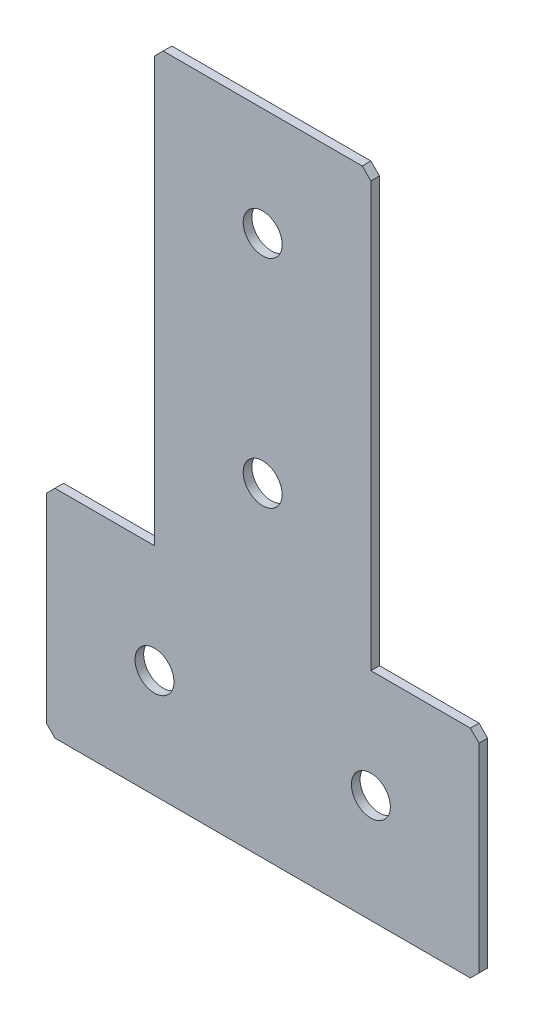
ISO-10303-21;
HEADER;
FILE_DESCRIPTION(('STEP AP214'),'2;1');
FILE_NAME('part.step','',(''),(''),'','','');
FILE_SCHEMA(('AUTOMOTIVE_DESIGN { 1 0 10303 214 1 1 1 1 }'));
ENDSEC;
DATA;
#1=APPLICATION_CONTEXT('core data for automotive mechanical design processes');
#2=APPLICATION_PROTOCOL_DEFINITION('international standard','automotive_design',2000,#1);
#3=PRODUCT_CONTEXT('',#1,'mechanical');
#4=PRODUCT('Part','Part','',(#3));
#5=PRODUCT_RELATED_PRODUCT_CATEGORY('part','',(#4));
#6=PRODUCT_DEFINITION_FORMATION('','',#4);
#7=PRODUCT_DEFINITION_CONTEXT('part definition',#1,'design');
#8=PRODUCT_DEFINITION('design','',#6,#7);
#9=PRODUCT_DEFINITION_SHAPE('','',#8);
#10=(LENGTH_UNIT() NAMED_UNIT(*) SI_UNIT(.MILLI.,.METRE.));
#11=(NAMED_UNIT(*) PLANE_ANGLE_UNIT() SI_UNIT($,.RADIAN.));
#12=(NAMED_UNIT(*) SI_UNIT($,.STERADIAN.) SOLID_ANGLE_UNIT());
#13=UNCERTAINTY_MEASURE_WITH_UNIT(LENGTH_MEASURE(1.E-05),#10,'distance_accuracy_value','');
#14=(GEOMETRIC_REPRESENTATION_CONTEXT(3) GLOBAL_UNCERTAINTY_ASSIGNED_CONTEXT((#13)) GLOBAL_UNIT_ASSIGNED_CONTEXT((#10,
#11,#12)) REPRESENTATION_CONTEXT('',''));
#15=CARTESIAN_POINT('',(0.,0.,0.));
#16=DIRECTION('',(0.,0.,1.));
#17=DIRECTION('',(1.,0.,0.));
#18=AXIS2_PLACEMENT_3D('',#15,#16,#17);
#19=CARTESIAN_POINT('',(-25.,-100.,-2.));
#20=DIRECTION('',(1.,0.,0.));
#21=DIRECTION('',(0.,1.,0.));
#22=AXIS2_PLACEMENT_3D('',#19,#20,#21);
#23=PLANE('',#22);
#24=DIRECTION('',(0.,1.,0.));
#25=VECTOR('',#24,1.);
#26=CARTESIAN_POINT('',(-25.,-100.,0.));
#27=LINE('',#26,#25);
#28=CARTESIAN_POINT('',(-25.,-100.,0.));
#29=VERTEX_POINT('',#28);
#30=CARTESIAN_POINT('',(-25.,-2.00000000000004,0.));
#31=VERTEX_POINT('',#30);
#32=EDGE_CURVE('E188',#29,#31,#27,.T.);
#33=ORIENTED_EDGE('',*,*,#32,.T.);
#34=DIRECTION('',(0.,0.,-1.));
#35=VECTOR('',#34,1.);
#36=CARTESIAN_POINT('',(-25.,-2.00000000000004,-2.));
#37=LINE('',#36,#35);
#38=CARTESIAN_POINT('',(-25.,-2.00000000000004,-2.));
#39=VERTEX_POINT('',#38);
#40=EDGE_CURVE('E278',#31,#39,#37,.T.);
#41=ORIENTED_EDGE('',*,*,#40,.T.);
#42=DIRECTION('',(0.,1.,0.));
#43=VECTOR('',#42,1.);
#44=CARTESIAN_POINT('',(-25.,-100.,-2.));
#45=LINE('',#44,#43);
#46=CARTESIAN_POINT('',(-25.,-100.,-2.));
#47=VERTEX_POINT('',#46);
#48=EDGE_CURVE('E216',#47,#39,#45,.T.);
#49=ORIENTED_EDGE('',*,*,#48,.F.);
#50=DIRECTION('',(0.,0.,1.));
#51=VECTOR('',#50,1.);
#52=CARTESIAN_POINT('',(-25.,-100.,-2.));
#53=LINE('',#52,#51);
#54=EDGE_CURVE('E168',#47,#29,#53,.T.);
#55=ORIENTED_EDGE('',*,*,#54,.T.);
#56=EDGE_LOOP('',(#33,#41,#49,#55));
#57=FACE_BOUND('',#56,.T.);
#58=ADVANCED_FACE('F39',(#57),#23,.F.);
#59=CARTESIAN_POINT('',(25.,0.,-2.));
#60=DIRECTION('',(0.,-1.,0.));
#61=DIRECTION('',(1.,0.,0.));
#62=AXIS2_PLACEMENT_3D('',#59,#60,#61);
#63=PLANE('',#62);
#64=DIRECTION('',(1.,0.,0.));
#65=VECTOR('',#64,1.);
#66=CARTESIAN_POINT('',(25.,0.,-2.));
#67=LINE('',#66,#65);
#68=CARTESIAN_POINT('',(-23.,0.,-2.));
#69=VERTEX_POINT('',#68);
#70=CARTESIAN_POINT('',(23.,0.,-2.));
#71=VERTEX_POINT('',#70);
#72=EDGE_CURVE('E156',#69,#71,#67,.T.);
#73=ORIENTED_EDGE('',*,*,#72,.F.);
#74=DIRECTION('',(0.,0.,1.));
#75=VECTOR('',#74,1.);
#76=CARTESIAN_POINT('',(-23.,0.,-2.));
#77=LINE('',#76,#75);
#78=CARTESIAN_POINT('',(-23.,0.,0.));
#79=VERTEX_POINT('',#78);
#80=EDGE_CURVE('E274',#69,#79,#77,.T.);
#81=ORIENTED_EDGE('',*,*,#80,.T.);
#82=DIRECTION('',(1.,0.,0.));
#83=VECTOR('',#82,1.);
#84=CARTESIAN_POINT('',(25.,0.,0.));
#85=LINE('',#84,#83);
#86=CARTESIAN_POINT('',(23.,0.,0.));
#87=VERTEX_POINT('',#86);
#88=EDGE_CURVE('E192',#79,#87,#85,.T.);
#89=ORIENTED_EDGE('',*,*,#88,.T.);
#90=DIRECTION('',(0.,0.,-1.));
#91=VECTOR('',#90,1.);
#92=CARTESIAN_POINT('',(23.,0.,-2.));
#93=LINE('',#92,#91);
#94=EDGE_CURVE('E271',#87,#71,#93,.T.);
#95=ORIENTED_EDGE('',*,*,#94,.T.);
#96=EDGE_LOOP('',(#73,#81,#89,#95));
#97=FACE_BOUND('',#96,.T.);
#98=ADVANCED_FACE('F331',(#97),#63,.F.);
#99=CARTESIAN_POINT('',(25.,-100.,-2.));
#100=DIRECTION('',(-1.,0.,0.));
#101=DIRECTION('',(0.,-1.,0.));
#102=AXIS2_PLACEMENT_3D('',#99,#100,#101);
#103=PLANE('',#102);
#104=DIRECTION('',(0.,-1.,0.));
#105=VECTOR('',#104,1.);
#106=CARTESIAN_POINT('',(25.,-100.,-2.));
#107=LINE('',#106,#105);
#108=CARTESIAN_POINT('',(25.,-2.,-2.));
#109=VERTEX_POINT('',#108);
#110=CARTESIAN_POINT('',(25.,-100.,-2.));
#111=VERTEX_POINT('',#110);
#112=EDGE_CURVE('E142',#109,#111,#107,.T.);
#113=ORIENTED_EDGE('',*,*,#112,.F.);
#114=DIRECTION('',(0.,0.,1.));
#115=VECTOR('',#114,1.);
#116=CARTESIAN_POINT('',(25.,-2.,-2.));
#117=LINE('',#116,#115);
#118=CARTESIAN_POINT('',(25.,-2.,0.));
#119=VERTEX_POINT('',#118);
#120=EDGE_CURVE('E281',#109,#119,#117,.T.);
#121=ORIENTED_EDGE('',*,*,#120,.T.);
#122=DIRECTION('',(0.,-1.,0.));
#123=VECTOR('',#122,1.);
#124=CARTESIAN_POINT('',(25.,-100.,0.));
#125=LINE('',#124,#123);
#126=CARTESIAN_POINT('',(25.,-100.,0.));
#127=VERTEX_POINT('',#126);
#128=EDGE_CURVE('E162',#119,#127,#125,.T.);
#129=ORIENTED_EDGE('',*,*,#128,.T.);
#130=DIRECTION('',(0.,0.,1.));
#131=VECTOR('',#130,1.);
#132=CARTESIAN_POINT('',(25.,-100.,-2.));
#133=LINE('',#132,#131);
#134=EDGE_CURVE('E159',#111,#127,#133,.T.);
#135=ORIENTED_EDGE('',*,*,#134,.F.);
#136=EDGE_LOOP('',(#113,#121,#129,#135));
#137=FACE_BOUND('',#136,.T.);
#138=ADVANCED_FACE('F160',(#137),#103,.F.);
#139=CARTESIAN_POINT('',(50.,-100.,-2.));
#140=DIRECTION('',(0.,-1.,0.));
#141=DIRECTION('',(0.,0.,-1.));
#142=AXIS2_PLACEMENT_3D('',#139,#140,#141);
#143=PLANE('',#142);
#144=DIRECTION('',(1.,0.,0.));
#145=VECTOR('',#144,1.);
#146=CARTESIAN_POINT('',(50.,-100.,0.));
#147=LINE('',#146,#145);
#148=CARTESIAN_POINT('',(48.,-100.,0.));
#149=VERTEX_POINT('',#148);
#150=EDGE_CURVE('E199',#127,#149,#147,.T.);
#151=ORIENTED_EDGE('',*,*,#150,.T.);
#152=DIRECTION('',(0.,0.,-1.));
#153=VECTOR('',#152,1.);
#154=CARTESIAN_POINT('',(48.,-100.,-2.));
#155=LINE('',#154,#153);
#156=CARTESIAN_POINT('',(48.,-100.,-2.));
#157=VERTEX_POINT('',#156);
#158=EDGE_CURVE('E11',#149,#157,#155,.T.);
#159=ORIENTED_EDGE('',*,*,#158,.T.);
#160=DIRECTION('',(1.,0.,0.));
#161=VECTOR('',#160,1.);
#162=CARTESIAN_POINT('',(50.,-100.,-2.));
#163=LINE('',#162,#161);
#164=EDGE_CURVE('E147',#111,#157,#163,.T.);
#165=ORIENTED_EDGE('',*,*,#164,.F.);
#166=ORIENTED_EDGE('',*,*,#134,.T.);
#167=EDGE_LOOP('',(#151,#159,#165,#166));
#168=FACE_BOUND('',#167,.T.);
#169=ADVANCED_FACE('F170',(#168),#143,.F.);
#170=CARTESIAN_POINT('',(50.,-150.,-2.));
#171=DIRECTION('',(-1.,0.,0.));
#172=DIRECTION('',(0.,0.,1.));
#173=AXIS2_PLACEMENT_3D('',#170,#171,#172);
#174=PLANE('',#173);
#175=DIRECTION('',(0.,-1.,0.));
#176=VECTOR('',#175,1.);
#177=CARTESIAN_POINT('',(50.,-150.,-2.));
#178=LINE('',#177,#176);
#179=CARTESIAN_POINT('',(50.,-102.,-2.));
#180=VERTEX_POINT('',#179);
#181=CARTESIAN_POINT('',(50.,-148.,-2.));
#182=VERTEX_POINT('',#181);
#183=EDGE_CURVE('E173',#180,#182,#178,.T.);
#184=ORIENTED_EDGE('',*,*,#183,.F.);
#185=DIRECTION('',(0.,0.,1.));
#186=VECTOR('',#185,1.);
#187=CARTESIAN_POINT('',(50.,-102.,-2.));
#188=LINE('',#187,#186);
#189=CARTESIAN_POINT('',(50.,-102.,0.));
#190=VERTEX_POINT('',#189);
#191=EDGE_CURVE('E48',#180,#190,#188,.T.);
#192=ORIENTED_EDGE('',*,*,#191,.T.);
#193=DIRECTION('',(0.,-1.,0.));
#194=VECTOR('',#193,1.);
#195=CARTESIAN_POINT('',(50.,-150.,0.));
#196=LINE('',#195,#194);
#197=CARTESIAN_POINT('',(50.,-148.,0.));
#198=VERTEX_POINT('',#197);
#199=EDGE_CURVE('E202',#190,#198,#196,.T.);
#200=ORIENTED_EDGE('',*,*,#199,.T.);
#201=DIRECTION('',(0.,0.,-1.));
#202=VECTOR('',#201,1.);
#203=CARTESIAN_POINT('',(50.,-148.,-2.));
#204=LINE('',#203,#202);
#205=EDGE_CURVE('E63',#198,#182,#204,.T.);
#206=ORIENTED_EDGE('',*,*,#205,.T.);
#207=EDGE_LOOP('',(#184,#192,#200,#206));
#208=FACE_BOUND('',#207,.T.);
#209=ADVANCED_FACE('F289',(#208),#174,.F.);
#210=CARTESIAN_POINT('',(-50.,-150.,-2.));
#211=DIRECTION('',(0.,1.,0.));
#212=DIRECTION('',(0.,0.,1.));
#213=AXIS2_PLACEMENT_3D('',#210,#211,#212);
#214=PLANE('',#213);
#215=DIRECTION('',(-1.,0.,0.));
#216=VECTOR('',#215,1.);
#217=CARTESIAN_POINT('',(-50.,-150.,0.));
#218=LINE('',#217,#216);
#219=CARTESIAN_POINT('',(48.,-150.,0.));
#220=VERTEX_POINT('',#219);
#221=CARTESIAN_POINT('',(-48.,-150.,0.));
#222=VERTEX_POINT('',#221);
#223=EDGE_CURVE('E205',#220,#222,#218,.T.);
#224=ORIENTED_EDGE('',*,*,#223,.T.);
#225=DIRECTION('',(0.,0.,-1.));
#226=VECTOR('',#225,1.);
#227=CARTESIAN_POINT('',(-48.,-150.,-2.));
#228=LINE('',#227,#226);
#229=CARTESIAN_POINT('',(-48.,-150.,-2.));
#230=VERTEX_POINT('',#229);
#231=EDGE_CURVE('E248',#222,#230,#228,.T.);
#232=ORIENTED_EDGE('',*,*,#231,.T.);
#233=DIRECTION('',(-1.,0.,0.));
#234=VECTOR('',#233,1.);
#235=CARTESIAN_POINT('',(-50.,-150.,-2.));
#236=LINE('',#235,#234);
#237=CARTESIAN_POINT('',(48.,-150.,-2.));
#238=VERTEX_POINT('',#237);
#239=EDGE_CURVE('E176',#238,#230,#236,.T.);
#240=ORIENTED_EDGE('',*,*,#239,.F.);
#241=DIRECTION('',(0.,0.,1.));
#242=VECTOR('',#241,1.);
#243=CARTESIAN_POINT('',(48.,-150.,-2.));
#244=LINE('',#243,#242);
#245=EDGE_CURVE('E244',#238,#220,#244,.T.);
#246=ORIENTED_EDGE('',*,*,#245,.T.);
#247=EDGE_LOOP('',(#224,#232,#240,#246));
#248=FACE_BOUND('',#247,.T.);
#249=ADVANCED_FACE('F300',(#248),#214,.F.);
#250=CARTESIAN_POINT('',(-50.,-150.,-2.));
#251=DIRECTION('',(1.,0.,0.));
#252=DIRECTION('',(0.,0.,-1.));
#253=AXIS2_PLACEMENT_3D('',#250,#251,#252);
#254=PLANE('',#253);
#255=DIRECTION('',(0.,1.,0.));
#256=VECTOR('',#255,1.);
#257=CARTESIAN_POINT('',(-50.,-150.,-2.));
#258=LINE('',#257,#256);
#259=CARTESIAN_POINT('',(-50.,-148.,-2.));
#260=VERTEX_POINT('',#259);
#261=CARTESIAN_POINT('',(-50.,-102.,-2.));
#262=VERTEX_POINT('',#261);
#263=EDGE_CURVE('E182',#260,#262,#258,.T.);
#264=ORIENTED_EDGE('',*,*,#263,.F.);
#265=DIRECTION('',(0.,0.,1.));
#266=VECTOR('',#265,1.);
#267=CARTESIAN_POINT('',(-50.,-148.,-2.));
#268=LINE('',#267,#266);
#269=CARTESIAN_POINT('',(-50.,-148.,0.));
#270=VERTEX_POINT('',#269);
#271=EDGE_CURVE('E222',#260,#270,#268,.T.);
#272=ORIENTED_EDGE('',*,*,#271,.T.);
#273=DIRECTION('',(0.,1.,0.));
#274=VECTOR('',#273,1.);
#275=CARTESIAN_POINT('',(-50.,-150.,0.));
#276=LINE('',#275,#274);
#277=CARTESIAN_POINT('',(-50.,-102.,0.));
#278=VERTEX_POINT('',#277);
#279=EDGE_CURVE('E209',#270,#278,#276,.T.);
#280=ORIENTED_EDGE('',*,*,#279,.T.);
#281=DIRECTION('',(0.,0.,-1.));
#282=VECTOR('',#281,1.);
#283=CARTESIAN_POINT('',(-50.,-102.,-2.));
#284=LINE('',#283,#282);
#285=EDGE_CURVE('E167',#278,#262,#284,.T.);
#286=ORIENTED_EDGE('',*,*,#285,.T.);
#287=EDGE_LOOP('',(#264,#272,#280,#286));
#288=FACE_BOUND('',#287,.T.);
#289=ADVANCED_FACE('F308',(#288),#254,.F.);
#290=CARTESIAN_POINT('',(-50.,-100.,-2.));
#291=DIRECTION('',(0.,-1.,0.));
#292=DIRECTION('',(0.,0.,-1.));
#293=AXIS2_PLACEMENT_3D('',#290,#291,#292);
#294=PLANE('',#293);
#295=DIRECTION('',(1.,0.,0.));
#296=VECTOR('',#295,1.);
#297=CARTESIAN_POINT('',(-50.,-100.,-2.));
#298=LINE('',#297,#296);
#299=CARTESIAN_POINT('',(-48.,-100.,-2.));
#300=VERTEX_POINT('',#299);
#301=EDGE_CURVE('E185',#300,#47,#298,.T.);
#302=ORIENTED_EDGE('',*,*,#301,.F.);
#303=DIRECTION('',(0.,0.,1.));
#304=VECTOR('',#303,1.);
#305=CARTESIAN_POINT('',(-48.,-100.,-2.));
#306=LINE('',#305,#304);
#307=CARTESIAN_POINT('',(-48.,-100.,0.));
#308=VERTEX_POINT('',#307);
#309=EDGE_CURVE('E267',#300,#308,#306,.T.);
#310=ORIENTED_EDGE('',*,*,#309,.T.);
#311=DIRECTION('',(1.,0.,0.));
#312=VECTOR('',#311,1.);
#313=CARTESIAN_POINT('',(-50.,-100.,0.));
#314=LINE('',#313,#312);
#315=EDGE_CURVE('E213',#308,#29,#314,.T.);
#316=ORIENTED_EDGE('',*,*,#315,.T.);
#317=ORIENTED_EDGE('',*,*,#54,.F.);
#318=EDGE_LOOP('',(#302,#310,#316,#317));
#319=FACE_BOUND('',#318,.T.);
#320=ADVANCED_FACE('F316',(#319),#294,.F.);
#321=CARTESIAN_POINT('',(0.,0.,-2.));
#322=DIRECTION('',(0.,0.,1.));
#323=DIRECTION('',(1.,0.,0.));
#324=AXIS2_PLACEMENT_3D('',#321,#322,#323);
#325=PLANE('',#324);
#326=CARTESIAN_POINT('',(-25.,-125.,-2.00000000000001));
#327=DIRECTION('',(0.,0.,-1.));
#328=DIRECTION('',(0.,1.,0.));
#329=AXIS2_PLACEMENT_3D('',#326,#327,#328);
#330=CIRCLE('',#329,4.5);
#331=CARTESIAN_POINT('',(-25.,-120.5,-2.00000000000001));
#332=VERTEX_POINT('',#331);
#333=EDGE_CURVE('E364',#332,#332,#330,.T.);
#334=ORIENTED_EDGE('',*,*,#333,.F.);
#335=EDGE_LOOP('',(#334));
#336=FACE_BOUND('',#335,.T.);
#337=CARTESIAN_POINT('',(25.,-125.,-2.00000000000001));
#338=DIRECTION('',(0.,0.,-1.));
#339=DIRECTION('',(0.,1.,0.));
#340=AXIS2_PLACEMENT_3D('',#337,#338,#339);
#341=CIRCLE('',#340,4.5);
#342=CARTESIAN_POINT('',(25.,-120.5,-2.00000000000001));
#343=VERTEX_POINT('',#342);
#344=EDGE_CURVE('E356',#343,#343,#341,.T.);
#345=ORIENTED_EDGE('',*,*,#344,.F.);
#346=EDGE_LOOP('',(#345));
#347=FACE_BOUND('',#346,.T.);
#348=CARTESIAN_POINT('',(0.,-75.,-2.));
#349=DIRECTION('',(0.,0.,-1.));
#350=DIRECTION('',(0.,1.,0.));
#351=AXIS2_PLACEMENT_3D('',#348,#349,#350);
#352=CIRCLE('',#351,4.5);
#353=CARTESIAN_POINT('',(0.,-70.5,-2.));
#354=VERTEX_POINT('',#353);
#355=EDGE_CURVE('E348',#354,#354,#352,.T.);
#356=ORIENTED_EDGE('',*,*,#355,.F.);
#357=EDGE_LOOP('',(#356));
#358=FACE_BOUND('',#357,.T.);
#359=CARTESIAN_POINT('',(0.,-25.,-2.));
#360=DIRECTION('',(0.,0.,-1.));
#361=DIRECTION('',(0.,1.,0.));
#362=AXIS2_PLACEMENT_3D('',#359,#360,#361);
#363=CIRCLE('',#362,4.5);
#364=CARTESIAN_POINT('',(0.,-20.5,-2.));
#365=VERTEX_POINT('',#364);
#366=EDGE_CURVE('E340',#365,#365,#363,.T.);
#367=ORIENTED_EDGE('',*,*,#366,.F.);
#368=EDGE_LOOP('',(#367));
#369=FACE_BOUND('',#368,.T.);
#370=ORIENTED_EDGE('',*,*,#239,.T.);
#371=DIRECTION('',(0.707106781186548,-0.707106781186548,0.));
#372=VECTOR('',#371,1.);
#373=CARTESIAN_POINT('',(-50.,-148.,-2.));
#374=LINE('',#373,#372);
#375=EDGE_CURVE('E264',#230,#260,#374,.F.);
#376=ORIENTED_EDGE('',*,*,#375,.T.);
#377=ORIENTED_EDGE('',*,*,#263,.T.);
#378=DIRECTION('',(-0.707106781186548,-0.707106781186548,0.));
#379=VECTOR('',#378,1.);
#380=CARTESIAN_POINT('',(-48.,-100.,-2.));
#381=LINE('',#380,#379);
#382=EDGE_CURVE('E55',#262,#300,#381,.F.);
#383=ORIENTED_EDGE('',*,*,#382,.T.);
#384=ORIENTED_EDGE('',*,*,#301,.T.);
#385=ORIENTED_EDGE('',*,*,#48,.T.);
#386=DIRECTION('',(-0.707106781186545,-0.70710678118655,0.));
#387=VECTOR('',#386,1.);
#388=CARTESIAN_POINT('',(-23.,0.,-2.));
#389=LINE('',#388,#387);
#390=EDGE_CURVE('E259',#39,#69,#389,.F.);
#391=ORIENTED_EDGE('',*,*,#390,.T.);
#392=ORIENTED_EDGE('',*,*,#72,.T.);
#393=DIRECTION('',(-0.707106781186554,0.707106781186542,0.));
#394=VECTOR('',#393,1.);
#395=CARTESIAN_POINT('',(25.,-2.,-2.));
#396=LINE('',#395,#394);
#397=EDGE_CURVE('E151',#71,#109,#396,.F.);
#398=ORIENTED_EDGE('',*,*,#397,.T.);
#399=ORIENTED_EDGE('',*,*,#112,.T.);
#400=ORIENTED_EDGE('',*,*,#164,.T.);
#401=DIRECTION('',(-0.707106781186548,0.707106781186548,0.));
#402=VECTOR('',#401,1.);
#403=CARTESIAN_POINT('',(50.,-102.,-2.));
#404=LINE('',#403,#402);
#405=EDGE_CURVE('E254',#157,#180,#404,.F.);
#406=ORIENTED_EDGE('',*,*,#405,.T.);
#407=ORIENTED_EDGE('',*,*,#183,.T.);
#408=DIRECTION('',(0.707106781186548,0.707106781186548,0.));
#409=VECTOR('',#408,1.);
#410=CARTESIAN_POINT('',(48.,-150.,-2.));
#411=LINE('',#410,#409);
#412=EDGE_CURVE('E251',#182,#238,#411,.F.);
#413=ORIENTED_EDGE('',*,*,#412,.T.);
#414=EDGE_LOOP('',(#370,#376,#377,#383,#384,#385,#391,#392,#398,#399,#400,#406,#407,#413));
#415=FACE_BOUND('',#414,.T.);
#416=ADVANCED_FACE('F145',(#336,#347,#358,#369,#415),#325,.F.);
#417=CARTESIAN_POINT('',(0.,0.,0.));
#418=DIRECTION('',(0.,0.,1.));
#419=DIRECTION('',(1.,0.,0.));
#420=AXIS2_PLACEMENT_3D('',#417,#418,#419);
#421=PLANE('',#420);
#422=CARTESIAN_POINT('',(-25.,-125.,0.));
#423=DIRECTION('',(0.,0.,-1.));
#424=DIRECTION('',(0.,1.,0.));
#425=AXIS2_PLACEMENT_3D('',#422,#423,#424);
#426=CIRCLE('',#425,4.5);
#427=CARTESIAN_POINT('',(-25.,-120.5,0.));
#428=VERTEX_POINT('',#427);
#429=EDGE_CURVE('E360',#428,#428,#426,.T.);
#430=ORIENTED_EDGE('',*,*,#429,.T.);
#431=EDGE_LOOP('',(#430));
#432=FACE_BOUND('',#431,.T.);
#433=CARTESIAN_POINT('',(25.,-125.,0.));
#434=DIRECTION('',(0.,0.,-1.));
#435=DIRECTION('',(0.,1.,0.));
#436=AXIS2_PLACEMENT_3D('',#433,#434,#435);
#437=CIRCLE('',#436,4.5);
#438=CARTESIAN_POINT('',(25.,-120.5,0.));
#439=VERTEX_POINT('',#438);
#440=EDGE_CURVE('E352',#439,#439,#437,.T.);
#441=ORIENTED_EDGE('',*,*,#440,.T.);
#442=EDGE_LOOP('',(#441));
#443=FACE_BOUND('',#442,.T.);
#444=CARTESIAN_POINT('',(0.,-75.,0.));
#445=DIRECTION('',(0.,0.,-1.));
#446=DIRECTION('',(0.,1.,0.));
#447=AXIS2_PLACEMENT_3D('',#444,#445,#446);
#448=CIRCLE('',#447,4.5);
#449=CARTESIAN_POINT('',(0.,-70.5,0.));
#450=VERTEX_POINT('',#449);
#451=EDGE_CURVE('E344',#450,#450,#448,.T.);
#452=ORIENTED_EDGE('',*,*,#451,.T.);
#453=EDGE_LOOP('',(#452));
#454=FACE_BOUND('',#453,.T.);
#455=CARTESIAN_POINT('',(0.,-25.,0.));
#456=DIRECTION('',(0.,0.,-1.));
#457=DIRECTION('',(0.,1.,0.));
#458=AXIS2_PLACEMENT_3D('',#455,#456,#457);
#459=CIRCLE('',#458,4.5);
#460=CARTESIAN_POINT('',(0.,-20.5,0.));
#461=VERTEX_POINT('',#460);
#462=EDGE_CURVE('E193',#461,#461,#459,.T.);
#463=ORIENTED_EDGE('',*,*,#462,.T.);
#464=EDGE_LOOP('',(#463));
#465=FACE_BOUND('',#464,.T.);
#466=ORIENTED_EDGE('',*,*,#279,.F.);
#467=DIRECTION('',(-0.707106781186548,0.707106781186548,0.));
#468=VECTOR('',#467,1.);
#469=CARTESIAN_POINT('',(-99.,-99.,0.));
#470=LINE('',#469,#468);
#471=EDGE_CURVE('E241',#270,#222,#470,.F.);
#472=ORIENTED_EDGE('',*,*,#471,.T.);
#473=ORIENTED_EDGE('',*,*,#223,.F.);
#474=DIRECTION('',(-0.707106781186548,-0.707106781186548,0.));
#475=VECTOR('',#474,1.);
#476=CARTESIAN_POINT('',(99.,-99.,0.));
#477=LINE('',#476,#475);
#478=EDGE_CURVE('E226',#220,#198,#477,.F.);
#479=ORIENTED_EDGE('',*,*,#478,.T.);
#480=ORIENTED_EDGE('',*,*,#199,.F.);
#481=DIRECTION('',(0.707106781186548,-0.707106781186548,0.));
#482=VECTOR('',#481,1.);
#483=CARTESIAN_POINT('',(-26.,-26.,0.));
#484=LINE('',#483,#482);
#485=EDGE_CURVE('E229',#190,#149,#484,.F.);
#486=ORIENTED_EDGE('',*,*,#485,.T.);
#487=ORIENTED_EDGE('',*,*,#150,.F.);
#488=ORIENTED_EDGE('',*,*,#128,.F.);
#489=DIRECTION('',(0.707106781186554,-0.707106781186542,0.));
#490=VECTOR('',#489,1.);
#491=CARTESIAN_POINT('',(11.4999999999998,11.5,0.));
#492=LINE('',#491,#490);
#493=EDGE_CURVE('E232',#119,#87,#492,.F.);
#494=ORIENTED_EDGE('',*,*,#493,.T.);
#495=ORIENTED_EDGE('',*,*,#88,.F.);
#496=DIRECTION('',(0.707106781186545,0.70710678118655,0.));
#497=VECTOR('',#496,1.);
#498=CARTESIAN_POINT('',(-11.5000000000001,11.5,0.));
#499=LINE('',#498,#497);
#500=EDGE_CURVE('E235',#79,#31,#499,.F.);
#501=ORIENTED_EDGE('',*,*,#500,.T.);
#502=ORIENTED_EDGE('',*,*,#32,.F.);
#503=ORIENTED_EDGE('',*,*,#315,.F.);
#504=DIRECTION('',(0.707106781186548,0.707106781186548,0.));
#505=VECTOR('',#504,1.);
#506=CARTESIAN_POINT('',(26.,-26.,0.));
#507=LINE('',#506,#505);
#508=EDGE_CURVE('E238',#308,#278,#507,.F.);
#509=ORIENTED_EDGE('',*,*,#508,.T.);
#510=EDGE_LOOP('',(#466,#472,#473,#479,#480,#486,#487,#488,#494,#495,#501,#502,#503,#509));
#511=FACE_BOUND('',#510,.T.);
#512=ADVANCED_FACE('F293',(#432,#443,#454,#465,#511),#421,.T.);
#513=CARTESIAN_POINT('',(0.,-25.,-2.));
#514=DIRECTION('',(0.,0.,-1.));
#515=DIRECTION('',(0.,1.,0.));
#516=AXIS2_PLACEMENT_3D('',#513,#514,#515);
#517=CYLINDRICAL_SURFACE('',#516,4.5);
#518=ORIENTED_EDGE('',*,*,#462,.F.);
#519=EDGE_LOOP('',(#518));
#520=FACE_BOUND('',#519,.T.);
#521=ORIENTED_EDGE('',*,*,#366,.T.);
#522=EDGE_LOOP('',(#521));
#523=FACE_BOUND('',#522,.T.);
#524=ADVANCED_FACE('F380',(#520,#523),#517,.F.);
#525=CARTESIAN_POINT('',(0.,-75.,-2.));
#526=DIRECTION('',(0.,0.,-1.));
#527=DIRECTION('',(0.,1.,0.));
#528=AXIS2_PLACEMENT_3D('',#525,#526,#527);
#529=CYLINDRICAL_SURFACE('',#528,4.5);
#530=ORIENTED_EDGE('',*,*,#451,.F.);
#531=EDGE_LOOP('',(#530));
#532=FACE_BOUND('',#531,.T.);
#533=ORIENTED_EDGE('',*,*,#355,.T.);
#534=EDGE_LOOP('',(#533));
#535=FACE_BOUND('',#534,.T.);
#536=ADVANCED_FACE('F382',(#532,#535),#529,.F.);
#537=CARTESIAN_POINT('',(25.,-125.,-2.00000000000001));
#538=DIRECTION('',(0.,0.,-1.));
#539=DIRECTION('',(0.,1.,0.));
#540=AXIS2_PLACEMENT_3D('',#537,#538,#539);
#541=CYLINDRICAL_SURFACE('',#540,4.5);
#542=ORIENTED_EDGE('',*,*,#440,.F.);
#543=EDGE_LOOP('',(#542));
#544=FACE_BOUND('',#543,.T.);
#545=ORIENTED_EDGE('',*,*,#344,.T.);
#546=EDGE_LOOP('',(#545));
#547=FACE_BOUND('',#546,.T.);
#548=ADVANCED_FACE('F389',(#544,#547),#541,.F.);
#549=CARTESIAN_POINT('',(-25.,-125.,-2.00000000000001));
#550=DIRECTION('',(0.,0.,-1.));
#551=DIRECTION('',(0.,1.,0.));
#552=AXIS2_PLACEMENT_3D('',#549,#550,#551);
#553=CYLINDRICAL_SURFACE('',#552,4.5);
#554=ORIENTED_EDGE('',*,*,#429,.F.);
#555=EDGE_LOOP('',(#554));
#556=FACE_BOUND('',#555,.T.);
#557=ORIENTED_EDGE('',*,*,#333,.T.);
#558=EDGE_LOOP('',(#557));
#559=FACE_BOUND('',#558,.T.);
#560=ADVANCED_FACE('F369',(#556,#559),#553,.F.);
#561=CARTESIAN_POINT('',(-50.,-148.,-2.));
#562=DIRECTION('',(0.707106781186547,0.707106781186547,0.));
#563=DIRECTION('',(0.,0.,1.));
#564=AXIS2_PLACEMENT_3D('',#561,#562,#563);
#565=PLANE('',#564);
#566=ORIENTED_EDGE('',*,*,#375,.F.);
#567=ORIENTED_EDGE('',*,*,#231,.F.);
#568=ORIENTED_EDGE('',*,*,#471,.F.);
#569=ORIENTED_EDGE('',*,*,#271,.F.);
#570=EDGE_LOOP('',(#566,#567,#568,#569));
#571=FACE_BOUND('',#570,.T.);
#572=ADVANCED_FACE('F306',(#571),#565,.F.);
#573=CARTESIAN_POINT('',(-48.,-100.,-2.));
#574=DIRECTION('',(0.707106781186547,-0.707106781186547,0.));
#575=DIRECTION('',(0.,0.,1.));
#576=AXIS2_PLACEMENT_3D('',#573,#574,#575);
#577=PLANE('',#576);
#578=ORIENTED_EDGE('',*,*,#382,.F.);
#579=ORIENTED_EDGE('',*,*,#285,.F.);
#580=ORIENTED_EDGE('',*,*,#508,.F.);
#581=ORIENTED_EDGE('',*,*,#309,.F.);
#582=EDGE_LOOP('',(#578,#579,#580,#581));
#583=FACE_BOUND('',#582,.T.);
#584=ADVANCED_FACE('F314',(#583),#577,.F.);
#585=CARTESIAN_POINT('',(-23.,0.,-2.));
#586=DIRECTION('',(0.70710678118655,-0.707106781186545,0.));
#587=DIRECTION('',(0.,0.,1.));
#588=AXIS2_PLACEMENT_3D('',#585,#586,#587);
#589=PLANE('',#588);
#590=ORIENTED_EDGE('',*,*,#390,.F.);
#591=ORIENTED_EDGE('',*,*,#40,.F.);
#592=ORIENTED_EDGE('',*,*,#500,.F.);
#593=ORIENTED_EDGE('',*,*,#80,.F.);
#594=EDGE_LOOP('',(#590,#591,#592,#593));
#595=FACE_BOUND('',#594,.T.);
#596=ADVANCED_FACE('F328',(#595),#589,.F.);
#597=CARTESIAN_POINT('',(25.,-2.,-2.));
#598=DIRECTION('',(-0.707106781186542,-0.707106781186554,0.));
#599=DIRECTION('',(0.,0.,1.));
#600=AXIS2_PLACEMENT_3D('',#597,#598,#599);
#601=PLANE('',#600);
#602=ORIENTED_EDGE('',*,*,#397,.F.);
#603=ORIENTED_EDGE('',*,*,#94,.F.);
#604=ORIENTED_EDGE('',*,*,#493,.F.);
#605=ORIENTED_EDGE('',*,*,#120,.F.);
#606=EDGE_LOOP('',(#602,#603,#604,#605));
#607=FACE_BOUND('',#606,.T.);
#608=ADVANCED_FACE('F334',(#607),#601,.F.);
#609=CARTESIAN_POINT('',(50.,-102.,-2.));
#610=DIRECTION('',(-0.707106781186547,-0.707106781186547,0.));
#611=DIRECTION('',(0.,0.,1.));
#612=AXIS2_PLACEMENT_3D('',#609,#610,#611);
#613=PLANE('',#612);
#614=ORIENTED_EDGE('',*,*,#405,.F.);
#615=ORIENTED_EDGE('',*,*,#158,.F.);
#616=ORIENTED_EDGE('',*,*,#485,.F.);
#617=ORIENTED_EDGE('',*,*,#191,.F.);
#618=EDGE_LOOP('',(#614,#615,#616,#617));
#619=FACE_BOUND('',#618,.T.);
#620=ADVANCED_FACE('F410',(#619),#613,.F.);
#621=CARTESIAN_POINT('',(48.,-150.,-2.));
#622=DIRECTION('',(-0.707106781186547,0.707106781186547,0.));
#623=DIRECTION('',(0.,0.,1.));
#624=AXIS2_PLACEMENT_3D('',#621,#622,#623);
#625=PLANE('',#624);
#626=ORIENTED_EDGE('',*,*,#412,.F.);
#627=ORIENTED_EDGE('',*,*,#205,.F.);
#628=ORIENTED_EDGE('',*,*,#478,.F.);
#629=ORIENTED_EDGE('',*,*,#245,.F.);
#630=EDGE_LOOP('',(#626,#627,#628,#629));
#631=FACE_BOUND('',#630,.T.);
#632=ADVANCED_FACE('F41',(#631),#625,.F.);
#633=CLOSED_SHELL('',(#58,#98,#138,#169,#209,#249,#289,#320,#416,#512,#524,#536,#548,#560,#572,
#584,#596,#608,#620,#632));
#634=MANIFOLD_SOLID_BREP('B2',#633);
#635=ADVANCED_BREP_SHAPE_REPRESENTATION('',(#18,#634),#14);
#636=SHAPE_DEFINITION_REPRESENTATION(#9,#635);
ENDSEC;
END-ISO-10303-21;
